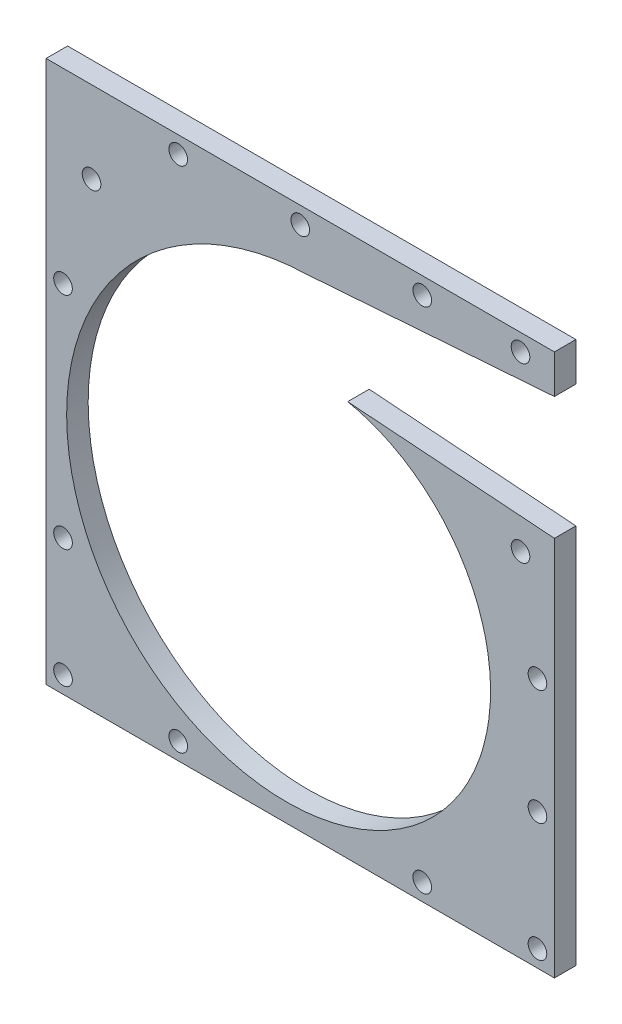
ISO-10303-21;
HEADER;
FILE_DESCRIPTION(('STEP AP214'),'2;1');
FILE_NAME('part.step','',(''),(''),'','','');
FILE_SCHEMA(('AUTOMOTIVE_DESIGN { 1 0 10303 214 1 1 1 1 }'));
ENDSEC;
DATA;
#1=APPLICATION_CONTEXT('core data for automotive mechanical design processes');
#2=APPLICATION_PROTOCOL_DEFINITION('international standard','automotive_design',2000,#1);
#3=PRODUCT_CONTEXT('',#1,'mechanical');
#4=PRODUCT('Part','Part','',(#3));
#5=PRODUCT_RELATED_PRODUCT_CATEGORY('part','',(#4));
#6=PRODUCT_DEFINITION_FORMATION('','',#4);
#7=PRODUCT_DEFINITION_CONTEXT('part definition',#1,'design');
#8=PRODUCT_DEFINITION('design','',#6,#7);
#9=PRODUCT_DEFINITION_SHAPE('','',#8);
#10=(LENGTH_UNIT() NAMED_UNIT(*) SI_UNIT(.MILLI.,.METRE.));
#11=(NAMED_UNIT(*) PLANE_ANGLE_UNIT() SI_UNIT($,.RADIAN.));
#12=(NAMED_UNIT(*) SI_UNIT($,.STERADIAN.) SOLID_ANGLE_UNIT());
#13=UNCERTAINTY_MEASURE_WITH_UNIT(LENGTH_MEASURE(1.E-05),#10,'distance_accuracy_value','');
#14=(GEOMETRIC_REPRESENTATION_CONTEXT(3) GLOBAL_UNCERTAINTY_ASSIGNED_CONTEXT((#13)) GLOBAL_UNIT_ASSIGNED_CONTEXT((#10,
#11,#12)) REPRESENTATION_CONTEXT('',''));
#15=CARTESIAN_POINT('',(0.,0.,0.));
#16=DIRECTION('',(0.,0.,1.));
#17=DIRECTION('',(1.,0.,0.));
#18=AXIS2_PLACEMENT_3D('',#15,#16,#17);
#19=CARTESIAN_POINT('',(131.81817467106,-7.78230033006967,6.35));
#20=DIRECTION('',(-1.,0.,0.));
#21=DIRECTION('',(0.,0.,1.));
#22=AXIS2_PLACEMENT_3D('',#19,#20,#21);
#23=PLANE('',#22);
#24=DIRECTION('',(0.,1.,0.));
#25=VECTOR('',#24,1.);
#26=CARTESIAN_POINT('',(131.81817467106,-7.78230033006967,6.35));
#27=LINE('',#26,#25);
#28=CARTESIAN_POINT('',(131.81817467106,140.809388742686,6.35));
#29=VERTEX_POINT('',#28);
#30=CARTESIAN_POINT('',(131.81817467106,152.21769966993,6.35));
#31=VERTEX_POINT('',#30);
#32=EDGE_CURVE('E124',#29,#31,#27,.T.);
#33=ORIENTED_EDGE('',*,*,#32,.F.);
#34=DIRECTION('',(0.,0.,1.));
#35=VECTOR('',#34,1.);
#36=CARTESIAN_POINT('',(131.81817467106,140.809388742686,-0.00100000000000013));
#37=LINE('',#36,#35);
#38=CARTESIAN_POINT('',(131.81817467106,140.809388742686,0.));
#39=VERTEX_POINT('',#38);
#40=EDGE_CURVE('E111',#39,#29,#37,.T.);
#41=ORIENTED_EDGE('',*,*,#40,.F.);
#42=DIRECTION('',(0.,1.,0.));
#43=VECTOR('',#42,1.);
#44=CARTESIAN_POINT('',(131.81817467106,-7.78230033006967,0.));
#45=LINE('',#44,#43);
#46=CARTESIAN_POINT('',(131.81817467106,152.21769966993,0.));
#47=VERTEX_POINT('',#46);
#48=EDGE_CURVE('E123',#39,#47,#45,.T.);
#49=ORIENTED_EDGE('',*,*,#48,.T.);
#50=DIRECTION('',(0.,0.,-1.));
#51=VECTOR('',#50,1.);
#52=CARTESIAN_POINT('',(131.81817467106,152.21769966993,6.35));
#53=LINE('',#52,#51);
#54=EDGE_CURVE('E140',#31,#47,#53,.T.);
#55=ORIENTED_EDGE('',*,*,#54,.F.);
#56=EDGE_LOOP('',(#33,#41,#49,#55));
#57=FACE_BOUND('',#56,.T.);
#58=ADVANCED_FACE('F33',(#57),#23,.F.);
#59=CARTESIAN_POINT('',(-18.1818253289395,-7.78230033006967,6.35));
#60=DIRECTION('',(1.,0.,0.));
#61=DIRECTION('',(0.,0.,-1.));
#62=AXIS2_PLACEMENT_3D('',#59,#60,#61);
#63=PLANE('',#62);
#64=DIRECTION('',(0.,-1.,0.));
#65=VECTOR('',#64,1.);
#66=CARTESIAN_POINT('',(-18.1818253289395,-7.78230033006967,0.));
#67=LINE('',#66,#65);
#68=CARTESIAN_POINT('',(-18.1818253289395,152.21769966993,0.));
#69=VERTEX_POINT('',#68);
#70=CARTESIAN_POINT('',(-18.1818253289395,-7.78230033006967,0.));
#71=VERTEX_POINT('',#70);
#72=EDGE_CURVE('E132',#69,#71,#67,.T.);
#73=ORIENTED_EDGE('',*,*,#72,.T.);
#74=DIRECTION('',(0.,0.,-1.));
#75=VECTOR('',#74,1.);
#76=CARTESIAN_POINT('',(-18.1818253289395,-7.78230033006967,6.35));
#77=LINE('',#76,#75);
#78=CARTESIAN_POINT('',(-18.1818253289395,-7.78230033006967,6.35));
#79=VERTEX_POINT('',#78);
#80=EDGE_CURVE('E11',#79,#71,#77,.T.);
#81=ORIENTED_EDGE('',*,*,#80,.F.);
#82=DIRECTION('',(0.,-1.,0.));
#83=VECTOR('',#82,1.);
#84=CARTESIAN_POINT('',(-18.1818253289395,-7.78230033006967,6.35));
#85=LINE('',#84,#83);
#86=CARTESIAN_POINT('',(-18.1818253289395,152.21769966993,6.35));
#87=VERTEX_POINT('',#86);
#88=EDGE_CURVE('E137',#87,#79,#85,.T.);
#89=ORIENTED_EDGE('',*,*,#88,.F.);
#90=DIRECTION('',(0.,0.,-1.));
#91=VECTOR('',#90,1.);
#92=CARTESIAN_POINT('',(-18.1818253289395,152.21769966993,6.35));
#93=LINE('',#92,#91);
#94=EDGE_CURVE('E138',#87,#69,#93,.T.);
#95=ORIENTED_EDGE('',*,*,#94,.T.);
#96=EDGE_LOOP('',(#73,#81,#89,#95));
#97=FACE_BOUND('',#96,.T.);
#98=ADVANCED_FACE('F35',(#97),#63,.F.);
#99=CARTESIAN_POINT('',(-18.1818253289395,-7.78230033006967,6.35));
#100=DIRECTION('',(0.,1.,0.));
#101=DIRECTION('',(0.,0.,1.));
#102=AXIS2_PLACEMENT_3D('',#99,#100,#101);
#103=PLANE('',#102);
#104=DIRECTION('',(1.,0.,0.));
#105=VECTOR('',#104,1.);
#106=CARTESIAN_POINT('',(-18.1818253289395,-7.78230033006967,0.));
#107=LINE('',#106,#105);
#108=CARTESIAN_POINT('',(131.81817467106,-7.78230033006967,0.));
#109=VERTEX_POINT('',#108);
#110=EDGE_CURVE('E129',#71,#109,#107,.T.);
#111=ORIENTED_EDGE('',*,*,#110,.T.);
#112=DIRECTION('',(0.,0.,-1.));
#113=VECTOR('',#112,1.);
#114=CARTESIAN_POINT('',(131.81817467106,-7.78230033006967,6.35));
#115=LINE('',#114,#113);
#116=CARTESIAN_POINT('',(131.81817467106,-7.78230033006967,6.35));
#117=VERTEX_POINT('',#116);
#118=EDGE_CURVE('E41',#117,#109,#115,.T.);
#119=ORIENTED_EDGE('',*,*,#118,.F.);
#120=DIRECTION('',(1.,0.,0.));
#121=VECTOR('',#120,1.);
#122=CARTESIAN_POINT('',(-18.1818253289395,-7.78230033006967,6.35));
#123=LINE('',#122,#121);
#124=EDGE_CURVE('E85',#79,#117,#123,.T.);
#125=ORIENTED_EDGE('',*,*,#124,.F.);
#126=ORIENTED_EDGE('',*,*,#80,.T.);
#127=EDGE_LOOP('',(#111,#119,#125,#126));
#128=FACE_BOUND('',#127,.T.);
#129=ADVANCED_FACE('F168',(#128),#103,.F.);
#130=CARTESIAN_POINT('',(131.81817467106,104.5788088434,0.));
#131=VERTEX_POINT('',#130);
#132=EDGE_CURVE('E128',#109,#131,#45,.T.);
#133=ORIENTED_EDGE('',*,*,#132,.T.);
#134=DIRECTION('',(0.,0.,1.));
#135=VECTOR('',#134,1.);
#136=CARTESIAN_POINT('',(131.81817467106,104.5788088434,-0.00100000000000013));
#137=LINE('',#136,#135);
#138=CARTESIAN_POINT('',(131.81817467106,104.5788088434,6.35));
#139=VERTEX_POINT('',#138);
#140=EDGE_CURVE('E48',#131,#139,#137,.T.);
#141=ORIENTED_EDGE('',*,*,#140,.T.);
#142=EDGE_CURVE('E147',#117,#139,#27,.T.);
#143=ORIENTED_EDGE('',*,*,#142,.F.);
#144=ORIENTED_EDGE('',*,*,#118,.T.);
#145=EDGE_LOOP('',(#133,#141,#143,#144));
#146=FACE_BOUND('',#145,.T.);
#147=ADVANCED_FACE('F145',(#146),#23,.F.);
#148=CARTESIAN_POINT('',(-18.1818253289395,152.21769966993,6.35));
#149=DIRECTION('',(0.,-1.,0.));
#150=DIRECTION('',(0.,0.,-1.));
#151=AXIS2_PLACEMENT_3D('',#148,#149,#150);
#152=PLANE('',#151);
#153=DIRECTION('',(-1.,0.,0.));
#154=VECTOR('',#153,1.);
#155=CARTESIAN_POINT('',(-18.1818253289395,152.21769966993,0.));
#156=LINE('',#155,#154);
#157=EDGE_CURVE('E78',#47,#69,#156,.T.);
#158=ORIENTED_EDGE('',*,*,#157,.T.);
#159=ORIENTED_EDGE('',*,*,#94,.F.);
#160=DIRECTION('',(-1.,0.,0.));
#161=VECTOR('',#160,1.);
#162=CARTESIAN_POINT('',(-18.1818253289395,152.21769966993,6.35));
#163=LINE('',#162,#161);
#164=EDGE_CURVE('E57',#31,#87,#163,.T.);
#165=ORIENTED_EDGE('',*,*,#164,.F.);
#166=ORIENTED_EDGE('',*,*,#54,.T.);
#167=EDGE_LOOP('',(#158,#159,#165,#166));
#168=FACE_BOUND('',#167,.T.);
#169=ADVANCED_FACE('F164',(#168),#152,.F.);
#170=CARTESIAN_POINT('',(0.,0.,6.35));
#171=DIRECTION('',(0.,0.,-1.));
#172=DIRECTION('',(-1.,0.,0.));
#173=AXIS2_PLACEMENT_3D('',#170,#171,#172);
#174=PLANE('',#173);
#175=CARTESIAN_POINT('',(121.81817467106,96.2176996699304,6.35));
#176=DIRECTION('',(0.,0.,1.));
#177=DIRECTION('',(1.,0.,0.));
#178=AXIS2_PLACEMENT_3D('',#175,#176,#177);
#179=CIRCLE('',#178,2.75000000000001);
#180=CARTESIAN_POINT('',(124.56817467106,96.2176996699304,6.35));
#181=VERTEX_POINT('',#180);
#182=EDGE_CURVE('E293',#181,#181,#179,.T.);
#183=ORIENTED_EDGE('',*,*,#182,.F.);
#184=EDGE_LOOP('',(#183));
#185=FACE_BOUND('',#184,.T.);
#186=CARTESIAN_POINT('',(126.81817467106,66.2176996699304,6.35));
#187=DIRECTION('',(0.,0.,1.));
#188=DIRECTION('',(1.,0.,0.));
#189=AXIS2_PLACEMENT_3D('',#186,#187,#188);
#190=CIRCLE('',#189,2.75000000000001);
#191=CARTESIAN_POINT('',(129.56817467106,66.2176996699304,6.35));
#192=VERTEX_POINT('',#191);
#193=EDGE_CURVE('E287',#192,#192,#190,.T.);
#194=ORIENTED_EDGE('',*,*,#193,.F.);
#195=EDGE_LOOP('',(#194));
#196=FACE_BOUND('',#195,.T.);
#197=CARTESIAN_POINT('',(126.81817467106,32.2176996699304,6.35));
#198=DIRECTION('',(0.,0.,1.));
#199=DIRECTION('',(1.,0.,0.));
#200=AXIS2_PLACEMENT_3D('',#197,#198,#199);
#201=CIRCLE('',#200,2.75000000000001);
#202=CARTESIAN_POINT('',(129.56817467106,32.2176996699304,6.35));
#203=VERTEX_POINT('',#202);
#204=EDGE_CURVE('E281',#203,#203,#201,.T.);
#205=ORIENTED_EDGE('',*,*,#204,.F.);
#206=EDGE_LOOP('',(#205));
#207=FACE_BOUND('',#206,.T.);
#208=CARTESIAN_POINT('',(126.81817467106,-2.78230033006961,6.35));
#209=DIRECTION('',(0.,0.,1.));
#210=DIRECTION('',(1.,0.,0.));
#211=AXIS2_PLACEMENT_3D('',#208,#209,#210);
#212=CIRCLE('',#211,2.74999999999998);
#213=CARTESIAN_POINT('',(129.56817467106,-2.78230033006961,6.35));
#214=VERTEX_POINT('',#213);
#215=EDGE_CURVE('E275',#214,#214,#212,.T.);
#216=ORIENTED_EDGE('',*,*,#215,.F.);
#217=EDGE_LOOP('',(#216));
#218=FACE_BOUND('',#217,.T.);
#219=CARTESIAN_POINT('',(92.8181746710605,-2.78230033006963,6.35));
#220=DIRECTION('',(0.,0.,1.));
#221=DIRECTION('',(1.,0.,0.));
#222=AXIS2_PLACEMENT_3D('',#219,#220,#221);
#223=CIRCLE('',#222,2.74999999999999);
#224=CARTESIAN_POINT('',(95.5681746710605,-2.78230033006963,6.35));
#225=VERTEX_POINT('',#224);
#226=EDGE_CURVE('E269',#225,#225,#223,.T.);
#227=ORIENTED_EDGE('',*,*,#226,.F.);
#228=EDGE_LOOP('',(#227));
#229=FACE_BOUND('',#228,.T.);
#230=CARTESIAN_POINT('',(20.8181746710605,-2.78230033006961,6.35));
#231=DIRECTION('',(0.,0.,1.));
#232=DIRECTION('',(1.,0.,0.));
#233=AXIS2_PLACEMENT_3D('',#230,#231,#232);
#234=CIRCLE('',#233,2.75);
#235=CARTESIAN_POINT('',(23.5681746710605,-2.78230033006961,6.35));
#236=VERTEX_POINT('',#235);
#237=EDGE_CURVE('E263',#236,#236,#234,.T.);
#238=ORIENTED_EDGE('',*,*,#237,.F.);
#239=EDGE_LOOP('',(#238));
#240=FACE_BOUND('',#239,.T.);
#241=CARTESIAN_POINT('',(-13.1818253289395,-2.78230033006961,6.35));
#242=DIRECTION('',(0.,0.,1.));
#243=DIRECTION('',(1.,0.,0.));
#244=AXIS2_PLACEMENT_3D('',#241,#242,#243);
#245=CIRCLE('',#244,2.75);
#246=CARTESIAN_POINT('',(-10.4318253289395,-2.78230033006961,6.35));
#247=VERTEX_POINT('',#246);
#248=EDGE_CURVE('E257',#247,#247,#245,.T.);
#249=ORIENTED_EDGE('',*,*,#248,.F.);
#250=EDGE_LOOP('',(#249));
#251=FACE_BOUND('',#250,.T.);
#252=CARTESIAN_POINT('',(-13.1818253289395,32.2176996699304,6.35));
#253=DIRECTION('',(0.,0.,1.));
#254=DIRECTION('',(1.,0.,0.));
#255=AXIS2_PLACEMENT_3D('',#252,#253,#254);
#256=CIRCLE('',#255,2.75);
#257=CARTESIAN_POINT('',(-10.4318253289395,32.2176996699304,6.35));
#258=VERTEX_POINT('',#257);
#259=EDGE_CURVE('E251',#258,#258,#256,.T.);
#260=ORIENTED_EDGE('',*,*,#259,.F.);
#261=EDGE_LOOP('',(#260));
#262=FACE_BOUND('',#261,.T.);
#263=CARTESIAN_POINT('',(-13.1818253289396,97.2176996699304,6.35));
#264=DIRECTION('',(0.,0.,1.));
#265=DIRECTION('',(1.,0.,0.));
#266=AXIS2_PLACEMENT_3D('',#263,#264,#265);
#267=CIRCLE('',#266,2.75);
#268=CARTESIAN_POINT('',(-10.4318253289396,97.2176996699304,6.35));
#269=VERTEX_POINT('',#268);
#270=EDGE_CURVE('E245',#269,#269,#267,.T.);
#271=ORIENTED_EDGE('',*,*,#270,.F.);
#272=EDGE_LOOP('',(#271));
#273=FACE_BOUND('',#272,.T.);
#274=CARTESIAN_POINT('',(-4.7745961983402,128.093555906569,6.35));
#275=DIRECTION('',(0.,0.,1.));
#276=DIRECTION('',(1.,0.,0.));
#277=AXIS2_PLACEMENT_3D('',#274,#275,#276);
#278=CIRCLE('',#277,2.75000000000001);
#279=CARTESIAN_POINT('',(-2.0245961983402,128.093555906569,6.35));
#280=VERTEX_POINT('',#279);
#281=EDGE_CURVE('E239',#280,#280,#278,.T.);
#282=ORIENTED_EDGE('',*,*,#281,.F.);
#283=EDGE_LOOP('',(#282));
#284=FACE_BOUND('',#283,.T.);
#285=CARTESIAN_POINT('',(20.8181746710604,147.21769966993,6.35));
#286=DIRECTION('',(0.,0.,1.));
#287=DIRECTION('',(1.,0.,0.));
#288=AXIS2_PLACEMENT_3D('',#285,#286,#287);
#289=CIRCLE('',#288,2.75);
#290=CARTESIAN_POINT('',(23.5681746710604,147.21769966993,6.35));
#291=VERTEX_POINT('',#290);
#292=EDGE_CURVE('E233',#291,#291,#289,.T.);
#293=ORIENTED_EDGE('',*,*,#292,.F.);
#294=EDGE_LOOP('',(#293));
#295=FACE_BOUND('',#294,.T.);
#296=CARTESIAN_POINT('',(56.8181746710604,147.21769966993,6.35));
#297=DIRECTION('',(0.,0.,1.));
#298=DIRECTION('',(1.,0.,0.));
#299=AXIS2_PLACEMENT_3D('',#296,#297,#298);
#300=CIRCLE('',#299,2.75000000000001);
#301=CARTESIAN_POINT('',(59.5681746710605,147.21769966993,6.35));
#302=VERTEX_POINT('',#301);
#303=EDGE_CURVE('E227',#302,#302,#300,.T.);
#304=ORIENTED_EDGE('',*,*,#303,.F.);
#305=EDGE_LOOP('',(#304));
#306=FACE_BOUND('',#305,.T.);
#307=CARTESIAN_POINT('',(92.8181746710605,147.21769966993,6.35));
#308=DIRECTION('',(0.,0.,1.));
#309=DIRECTION('',(1.,0.,0.));
#310=AXIS2_PLACEMENT_3D('',#307,#308,#309);
#311=CIRCLE('',#310,2.75000000000002);
#312=CARTESIAN_POINT('',(95.5681746710605,147.21769966993,6.35));
#313=VERTEX_POINT('',#312);
#314=EDGE_CURVE('E222',#313,#313,#311,.T.);
#315=ORIENTED_EDGE('',*,*,#314,.F.);
#316=EDGE_LOOP('',(#315));
#317=FACE_BOUND('',#316,.T.);
#318=CARTESIAN_POINT('',(121.81817467106,147.21769966993,6.35));
#319=DIRECTION('',(0.,0.,1.));
#320=DIRECTION('',(1.,0.,0.));
#321=AXIS2_PLACEMENT_3D('',#318,#319,#320);
#322=CIRCLE('',#321,2.75000000000002);
#323=CARTESIAN_POINT('',(124.56817467106,147.21769966993,6.35));
#324=VERTEX_POINT('',#323);
#325=EDGE_CURVE('E211',#324,#324,#322,.T.);
#326=ORIENTED_EDGE('',*,*,#325,.F.);
#327=EDGE_LOOP('',(#326));
#328=FACE_BOUND('',#327,.T.);
#329=CARTESIAN_POINT('',(58.9214000295519,135.51433119546,6.35));
#330=CARTESIAN_POINT('',(54.1832252012254,135.390580552711,6.35));
#331=CARTESIAN_POINT('',(49.4811791212116,134.818294383119,6.35));
#332=CARTESIAN_POINT('',(40.3143270370534,132.814916259366,6.35));
#333=CARTESIAN_POINT('',(35.8497067088032,131.383908814256,6.35));
#334=CARTESIAN_POINT('',(27.3113098813154,127.731327501189,6.35));
#335=CARTESIAN_POINT('',(23.2376980288108,125.509870744257,6.35));
#336=CARTESIAN_POINT('',(15.6178631561521,120.371467782945,6.35));
#337=CARTESIAN_POINT('',(12.071778180712,117.454666428956,6.35));
#338=CARTESIAN_POINT('',(5.62192202345862,111.043539372666,6.35));
#339=CARTESIAN_POINT('',(2.71825778304008,107.549380476169,6.35));
#340=CARTESIAN_POINT('',(-2.35714333069762,100.119693236984,6.35));
#341=CARTESIAN_POINT('',(-4.52880765000477,96.1843471782258,6.35));
#342=CARTESIAN_POINT('',(-8.07861082646921,88.021368006585,6.35));
#343=CARTESIAN_POINT('',(-9.45671348535184,83.7939257347283,6.35));
#344=CARTESIAN_POINT('',(-11.3874484342981,75.2031396839304,6.35));
#345=CARTESIAN_POINT('',(-11.9400814860633,70.8399881999389,6.35));
#346=CARTESIAN_POINT('',(-12.2181181019159,62.1356974664072,6.35));
#347=CARTESIAN_POINT('',(-11.9435586304208,57.7947449441921,6.35));
#348=CARTESIAN_POINT('',(-10.5950667121722,49.2885813874234,6.35));
#349=CARTESIAN_POINT('',(-9.52120536648954,45.1235448288076,6.35));
#350=CARTESIAN_POINT('',(-6.62995153486292,37.1133141318664,6.35));
#351=CARTESIAN_POINT('',(-4.81266101177187,33.2682761113291,6.35));
#352=CARTESIAN_POINT('',(-0.515766072057898,26.0275328968687,6.35));
#353=CARTESIAN_POINT('',(1.96370986081187,22.6319601465299,6.35));
#354=CARTESIAN_POINT('',(7.48185763942838,16.4006789257721,6.35));
#355=CARTESIAN_POINT('',(10.520379707818,13.5650748801135,6.35));
#356=CARTESIAN_POINT('',(17.0357962281535,8.5417345056182,6.35));
#357=CARTESIAN_POINT('',(20.5125255137325,6.35407135114097,6.35));
#358=CARTESIAN_POINT('',(27.7705752596686,2.68941263794072,6.35));
#359=CARTESIAN_POINT('',(31.5517215161605,1.21245698255238,6.35));
#360=CARTESIAN_POINT('',(39.2769821069911,-0.994893307784299,6.35));
#361=CARTESIAN_POINT('',(43.220919755662,-1.72528206876122,6.35));
#362=CARTESIAN_POINT('',(51.1275872911127,-2.43120001063375,6.35));
#363=CARTESIAN_POINT('',(55.0901445244449,-2.40675683932256,6.35));
#364=CARTESIAN_POINT('',(62.8925881370057,-1.62197741777496,6.35));
#365=CARTESIAN_POINT('',(66.7323121275655,-0.861700606896201,6.35));
#366=CARTESIAN_POINT('',(74.1553886157406,1.34982876975539,6.35));
#367=CARTESIAN_POINT('',(77.738594715652,2.8009929695185,6.35));
#368=CARTESIAN_POINT('',(84.52735091309,6.32565833587609,6.35));
#369=CARTESIAN_POINT('',(87.7327756217776,8.39904608104586,6.35));
#370=CARTESIAN_POINT('',(93.6611963751031,13.0788411833024,6.35));
#371=CARTESIAN_POINT('',(96.3840921775814,15.6851147777265,6.35));
#372=CARTESIAN_POINT('',(101.262594087518,21.3244126392845,6.35));
#373=CARTESIAN_POINT('',(103.418128221415,24.3572881679707,6.35));
#374=CARTESIAN_POINT('',(107.099551849488,30.7308284722986,6.35));
#375=CARTESIAN_POINT('',(108.625399649337,34.0713353381564,6.35));
#376=CARTESIAN_POINT('',(111.009313557055,40.9331072200376,6.35));
#377=CARTESIAN_POINT('',(111.867369097047,44.4542111737959,6.35));
#378=CARTESIAN_POINT('',(112.902565452163,51.5468847583791,6.35));
#379=CARTESIAN_POINT('',(113.079726501959,55.118296179449,6.35));
#380=CARTESIAN_POINT('',(112.764857473672,62.1828433704138,6.35));
#381=CARTESIAN_POINT('',(112.272876974003,65.6758295508589,6.35));
#382=CARTESIAN_POINT('',(110.655251091939,72.4609753654911,6.35));
#383=CARTESIAN_POINT('',(109.52968211595,75.7529993510267,6.35));
#384=CARTESIAN_POINT('',(106.702307563576,82.0241592371306,6.35));
#385=CARTESIAN_POINT('',(105.00060176492,85.0031781138044,6.35));
#386=CARTESIAN_POINT('',(101.097626722405,90.5505633721843,6.35));
#387=CARTESIAN_POINT('',(98.8964763790319,93.1188352405475,6.35));
#388=CARTESIAN_POINT('',(94.0872327497071,97.7644466714173,6.35));
#389=CARTESIAN_POINT('',(91.479272622332,99.8417171903127,6.35));
#390=CARTESIAN_POINT('',(85.9611767992722,103.444994734487,6.35));
#391=CARTESIAN_POINT('',(83.051183234939,104.970960127402,6.35));
#392=CARTESIAN_POINT('',(77.041784389658,107.432911602492,6.35));
#393=CARTESIAN_POINT('',(73.9425247142314,108.368884336489,6.35));
#394=CARTESIAN_POINT('',(70.8067704787731,109.0017307388,6.35));
#395=B_SPLINE_CURVE_WITH_KNOTS('',3,(#329,#330,#331,#332,#333,#334,#335,#336,#337,#338,#339,
#340,#341,#342,#343,#344,#345,#346,#347,#348,#349,#350,#351,#352,#353,#354,#355,#356,#357,#358,
#359,#360,#361,#362,#363,#364,#365,#366,#367,#368,#369,#370,#371,#372,#373,#374,#375,#376,#377,
#378,#379,#380,#381,#382,#383,#384,#385,#386,#387,#388,#389,#390,#391,#392,#393,#394),
.UNSPECIFIED.,.F.,.F.,(4,2,2,2,2,2,2,2,2,2,2,2,2,2,2,2,2,2,2,2,2,2,2,2,2,2,2,2,2,2,2,2,4),(0.,
0.03125,0.0625,0.09375,0.125,0.15625,0.1875,0.21875,0.25,0.28125,0.3125,0.34375,0.375,0.40625,
0.4375,0.46875,0.5,0.53125,0.5625,0.59375,0.625,0.65625,0.6875,0.71875,0.75,0.78125,0.8125,
0.84375,0.875,0.90625,0.9375,0.96875,1.),.UNSPECIFIED.);
#396=CARTESIAN_POINT('',(58.9214000295519,135.51433119546,6.35));
#397=VERTEX_POINT('',#396);
#398=CARTESIAN_POINT('',(70.8067704787731,109.0017307388,6.35));
#399=VERTEX_POINT('',#398);
#400=EDGE_CURVE('E117',#397,#399,#395,.T.);
#401=ORIENTED_EDGE('',*,*,#400,.F.);
#402=DIRECTION('',(-0.997372272616975,-0.0724468758115244,0.));
#403=VECTOR('',#402,1.);
#404=CARTESIAN_POINT('',(58.9214000295519,135.51433119546,6.35));
#405=LINE('',#404,#403);
#406=EDGE_CURVE('E163',#29,#397,#405,.T.);
#407=ORIENTED_EDGE('',*,*,#406,.F.);
#408=ORIENTED_EDGE('',*,*,#32,.T.);
#409=ORIENTED_EDGE('',*,*,#164,.T.);
#410=ORIENTED_EDGE('',*,*,#88,.T.);
#411=ORIENTED_EDGE('',*,*,#124,.T.);
#412=ORIENTED_EDGE('',*,*,#142,.T.);
#413=DIRECTION('',(0.997382667751315,-0.0723036241779725,0.));
#414=VECTOR('',#413,1.);
#415=CARTESIAN_POINT('',(131.81817467106,104.5788088434,6.35));
#416=LINE('',#415,#414);
#417=EDGE_CURVE('E206',#399,#139,#416,.T.);
#418=ORIENTED_EDGE('',*,*,#417,.F.);
#419=EDGE_LOOP('',(#401,#407,#408,#409,#410,#411,#412,#418));
#420=FACE_BOUND('',#419,.T.);
#421=ADVANCED_FACE('F162',(#185,#196,#207,#218,#229,#240,#251,#262,#273,#284,#295,#306,#317,
#328,#420),#174,.F.);
#422=CARTESIAN_POINT('',(0.,0.,0.));
#423=DIRECTION('',(0.,0.,-1.));
#424=DIRECTION('',(-1.,0.,0.));
#425=AXIS2_PLACEMENT_3D('',#422,#423,#424);
#426=PLANE('',#425);
#427=CARTESIAN_POINT('',(121.81817467106,96.2176996699304,0.));
#428=DIRECTION('',(0.,0.,-1.));
#429=DIRECTION('',(-1.,0.,0.));
#430=AXIS2_PLACEMENT_3D('',#427,#428,#429);
#431=CIRCLE('',#430,2.75000000000001);
#432=CARTESIAN_POINT('',(119.06817467106,96.2176996699304,0.));
#433=VERTEX_POINT('',#432);
#434=EDGE_CURVE('E296',#433,#433,#431,.F.);
#435=ORIENTED_EDGE('',*,*,#434,.T.);
#436=EDGE_LOOP('',(#435));
#437=FACE_BOUND('',#436,.T.);
#438=CARTESIAN_POINT('',(126.81817467106,66.2176996699304,0.));
#439=DIRECTION('',(0.,0.,-1.));
#440=DIRECTION('',(-1.,0.,0.));
#441=AXIS2_PLACEMENT_3D('',#438,#439,#440);
#442=CIRCLE('',#441,2.75000000000001);
#443=CARTESIAN_POINT('',(124.06817467106,66.2176996699304,0.));
#444=VERTEX_POINT('',#443);
#445=EDGE_CURVE('E290',#444,#444,#442,.F.);
#446=ORIENTED_EDGE('',*,*,#445,.T.);
#447=EDGE_LOOP('',(#446));
#448=FACE_BOUND('',#447,.T.);
#449=CARTESIAN_POINT('',(126.81817467106,32.2176996699304,0.));
#450=DIRECTION('',(0.,0.,-1.));
#451=DIRECTION('',(-1.,0.,0.));
#452=AXIS2_PLACEMENT_3D('',#449,#450,#451);
#453=CIRCLE('',#452,2.75000000000001);
#454=CARTESIAN_POINT('',(124.06817467106,32.2176996699304,0.));
#455=VERTEX_POINT('',#454);
#456=EDGE_CURVE('E284',#455,#455,#453,.F.);
#457=ORIENTED_EDGE('',*,*,#456,.T.);
#458=EDGE_LOOP('',(#457));
#459=FACE_BOUND('',#458,.T.);
#460=CARTESIAN_POINT('',(126.81817467106,-2.78230033006961,0.));
#461=DIRECTION('',(0.,0.,-1.));
#462=DIRECTION('',(-1.,0.,0.));
#463=AXIS2_PLACEMENT_3D('',#460,#461,#462);
#464=CIRCLE('',#463,2.74999999999998);
#465=CARTESIAN_POINT('',(124.068174671061,-2.78230033006961,0.));
#466=VERTEX_POINT('',#465);
#467=EDGE_CURVE('E278',#466,#466,#464,.F.);
#468=ORIENTED_EDGE('',*,*,#467,.T.);
#469=EDGE_LOOP('',(#468));
#470=FACE_BOUND('',#469,.T.);
#471=CARTESIAN_POINT('',(92.8181746710605,-2.78230033006963,0.));
#472=DIRECTION('',(0.,0.,-1.));
#473=DIRECTION('',(-1.,0.,0.));
#474=AXIS2_PLACEMENT_3D('',#471,#472,#473);
#475=CIRCLE('',#474,2.74999999999999);
#476=CARTESIAN_POINT('',(90.0681746710605,-2.78230033006963,0.));
#477=VERTEX_POINT('',#476);
#478=EDGE_CURVE('E272',#477,#477,#475,.F.);
#479=ORIENTED_EDGE('',*,*,#478,.T.);
#480=EDGE_LOOP('',(#479));
#481=FACE_BOUND('',#480,.T.);
#482=CARTESIAN_POINT('',(20.8181746710605,-2.78230033006961,0.));
#483=DIRECTION('',(0.,0.,-1.));
#484=DIRECTION('',(-1.,0.,0.));
#485=AXIS2_PLACEMENT_3D('',#482,#483,#484);
#486=CIRCLE('',#485,2.75);
#487=CARTESIAN_POINT('',(18.0681746710605,-2.78230033006961,0.));
#488=VERTEX_POINT('',#487);
#489=EDGE_CURVE('E266',#488,#488,#486,.F.);
#490=ORIENTED_EDGE('',*,*,#489,.T.);
#491=EDGE_LOOP('',(#490));
#492=FACE_BOUND('',#491,.T.);
#493=CARTESIAN_POINT('',(-13.1818253289395,-2.78230033006961,0.));
#494=DIRECTION('',(0.,0.,-1.));
#495=DIRECTION('',(-1.,0.,0.));
#496=AXIS2_PLACEMENT_3D('',#493,#494,#495);
#497=CIRCLE('',#496,2.75);
#498=CARTESIAN_POINT('',(-15.9318253289395,-2.78230033006961,0.));
#499=VERTEX_POINT('',#498);
#500=EDGE_CURVE('E260',#499,#499,#497,.F.);
#501=ORIENTED_EDGE('',*,*,#500,.T.);
#502=EDGE_LOOP('',(#501));
#503=FACE_BOUND('',#502,.T.);
#504=CARTESIAN_POINT('',(-13.1818253289395,32.2176996699304,0.));
#505=DIRECTION('',(0.,0.,-1.));
#506=DIRECTION('',(-1.,0.,0.));
#507=AXIS2_PLACEMENT_3D('',#504,#505,#506);
#508=CIRCLE('',#507,2.75);
#509=CARTESIAN_POINT('',(-15.9318253289395,32.2176996699304,0.));
#510=VERTEX_POINT('',#509);
#511=EDGE_CURVE('E254',#510,#510,#508,.F.);
#512=ORIENTED_EDGE('',*,*,#511,.T.);
#513=EDGE_LOOP('',(#512));
#514=FACE_BOUND('',#513,.T.);
#515=CARTESIAN_POINT('',(-13.1818253289396,97.2176996699304,0.));
#516=DIRECTION('',(0.,0.,-1.));
#517=DIRECTION('',(-1.,0.,0.));
#518=AXIS2_PLACEMENT_3D('',#515,#516,#517);
#519=CIRCLE('',#518,2.75);
#520=CARTESIAN_POINT('',(-15.9318253289396,97.2176996699304,0.));
#521=VERTEX_POINT('',#520);
#522=EDGE_CURVE('E248',#521,#521,#519,.F.);
#523=ORIENTED_EDGE('',*,*,#522,.T.);
#524=EDGE_LOOP('',(#523));
#525=FACE_BOUND('',#524,.T.);
#526=CARTESIAN_POINT('',(-4.7745961983402,128.093555906569,0.));
#527=DIRECTION('',(0.,0.,-1.));
#528=DIRECTION('',(-1.,0.,0.));
#529=AXIS2_PLACEMENT_3D('',#526,#527,#528);
#530=CIRCLE('',#529,2.75000000000001);
#531=CARTESIAN_POINT('',(-7.52459619834021,128.093555906569,0.));
#532=VERTEX_POINT('',#531);
#533=EDGE_CURVE('E242',#532,#532,#530,.F.);
#534=ORIENTED_EDGE('',*,*,#533,.T.);
#535=EDGE_LOOP('',(#534));
#536=FACE_BOUND('',#535,.T.);
#537=CARTESIAN_POINT('',(20.8181746710604,147.21769966993,0.));
#538=DIRECTION('',(0.,0.,-1.));
#539=DIRECTION('',(-1.,0.,0.));
#540=AXIS2_PLACEMENT_3D('',#537,#538,#539);
#541=CIRCLE('',#540,2.75);
#542=CARTESIAN_POINT('',(18.0681746710604,147.21769966993,0.));
#543=VERTEX_POINT('',#542);
#544=EDGE_CURVE('E236',#543,#543,#541,.F.);
#545=ORIENTED_EDGE('',*,*,#544,.T.);
#546=EDGE_LOOP('',(#545));
#547=FACE_BOUND('',#546,.T.);
#548=CARTESIAN_POINT('',(56.8181746710604,147.21769966993,0.));
#549=DIRECTION('',(0.,0.,-1.));
#550=DIRECTION('',(-1.,0.,0.));
#551=AXIS2_PLACEMENT_3D('',#548,#549,#550);
#552=CIRCLE('',#551,2.75000000000001);
#553=CARTESIAN_POINT('',(54.0681746710604,147.21769966993,0.));
#554=VERTEX_POINT('',#553);
#555=EDGE_CURVE('E230',#554,#554,#552,.F.);
#556=ORIENTED_EDGE('',*,*,#555,.T.);
#557=EDGE_LOOP('',(#556));
#558=FACE_BOUND('',#557,.T.);
#559=CARTESIAN_POINT('',(92.8181746710605,147.21769966993,0.));
#560=DIRECTION('',(0.,0.,-1.));
#561=DIRECTION('',(-1.,0.,0.));
#562=AXIS2_PLACEMENT_3D('',#559,#560,#561);
#563=CIRCLE('',#562,2.75000000000002);
#564=CARTESIAN_POINT('',(90.0681746710604,147.21769966993,0.));
#565=VERTEX_POINT('',#564);
#566=EDGE_CURVE('E224',#565,#565,#563,.F.);
#567=ORIENTED_EDGE('',*,*,#566,.T.);
#568=EDGE_LOOP('',(#567));
#569=FACE_BOUND('',#568,.T.);
#570=CARTESIAN_POINT('',(121.81817467106,147.21769966993,0.));
#571=DIRECTION('',(0.,0.,-1.));
#572=DIRECTION('',(-1.,0.,0.));
#573=AXIS2_PLACEMENT_3D('',#570,#571,#572);
#574=CIRCLE('',#573,2.75000000000002);
#575=CARTESIAN_POINT('',(119.06817467106,147.21769966993,0.));
#576=VERTEX_POINT('',#575);
#577=EDGE_CURVE('E213',#576,#576,#574,.F.);
#578=ORIENTED_EDGE('',*,*,#577,.T.);
#579=EDGE_LOOP('',(#578));
#580=FACE_BOUND('',#579,.T.);
#581=DIRECTION('',(-0.997372272616975,-0.0724468758115244,0.));
#582=VECTOR('',#581,1.);
#583=CARTESIAN_POINT('',(58.9214000295519,135.51433119546,0.));
#584=LINE('',#583,#582);
#585=CARTESIAN_POINT('',(58.9214000295519,135.51433119546,0.));
#586=VERTEX_POINT('',#585);
#587=EDGE_CURVE('E107',#39,#586,#584,.T.);
#588=ORIENTED_EDGE('',*,*,#587,.T.);
#589=CARTESIAN_POINT('',(58.9214000295519,135.51433119546,0.));
#590=CARTESIAN_POINT('',(54.1832252012254,135.390580552711,0.));
#591=CARTESIAN_POINT('',(49.4811791212116,134.818294383119,0.));
#592=CARTESIAN_POINT('',(40.3143270370534,132.814916259366,0.));
#593=CARTESIAN_POINT('',(35.8497067088032,131.383908814256,0.));
#594=CARTESIAN_POINT('',(27.3113098813154,127.731327501189,0.));
#595=CARTESIAN_POINT('',(23.2376980288108,125.509870744257,0.));
#596=CARTESIAN_POINT('',(15.6178631561521,120.371467782945,0.));
#597=CARTESIAN_POINT('',(12.071778180712,117.454666428956,0.));
#598=CARTESIAN_POINT('',(5.62192202345862,111.043539372666,0.));
#599=CARTESIAN_POINT('',(2.71825778304008,107.549380476169,0.));
#600=CARTESIAN_POINT('',(-2.35714333069762,100.119693236984,0.));
#601=CARTESIAN_POINT('',(-4.52880765000477,96.1843471782258,0.));
#602=CARTESIAN_POINT('',(-8.07861082646921,88.021368006585,0.));
#603=CARTESIAN_POINT('',(-9.45671348535184,83.7939257347283,0.));
#604=CARTESIAN_POINT('',(-11.3874484342981,75.2031396839304,0.));
#605=CARTESIAN_POINT('',(-11.9400814860633,70.8399881999389,0.));
#606=CARTESIAN_POINT('',(-12.2181181019159,62.1356974664072,0.));
#607=CARTESIAN_POINT('',(-11.9435586304208,57.7947449441921,0.));
#608=CARTESIAN_POINT('',(-10.5950667121722,49.2885813874234,0.));
#609=CARTESIAN_POINT('',(-9.52120536648954,45.1235448288076,0.));
#610=CARTESIAN_POINT('',(-6.62995153486292,37.1133141318664,0.));
#611=CARTESIAN_POINT('',(-4.81266101177187,33.2682761113291,0.));
#612=CARTESIAN_POINT('',(-0.515766072057898,26.0275328968687,0.));
#613=CARTESIAN_POINT('',(1.96370986081187,22.6319601465299,0.));
#614=CARTESIAN_POINT('',(7.48185763942838,16.4006789257721,0.));
#615=CARTESIAN_POINT('',(10.520379707818,13.5650748801135,0.));
#616=CARTESIAN_POINT('',(17.0357962281535,8.5417345056182,0.));
#617=CARTESIAN_POINT('',(20.5125255137325,6.35407135114097,0.));
#618=CARTESIAN_POINT('',(27.7705752596686,2.68941263794072,0.));
#619=CARTESIAN_POINT('',(31.5517215161605,1.21245698255238,0.));
#620=CARTESIAN_POINT('',(39.2769821069911,-0.994893307784299,0.));
#621=CARTESIAN_POINT('',(43.220919755662,-1.72528206876122,0.));
#622=CARTESIAN_POINT('',(51.1275872911127,-2.43120001063375,0.));
#623=CARTESIAN_POINT('',(55.0901445244449,-2.40675683932256,0.));
#624=CARTESIAN_POINT('',(62.8925881370057,-1.62197741777496,0.));
#625=CARTESIAN_POINT('',(66.7323121275655,-0.861700606896201,0.));
#626=CARTESIAN_POINT('',(74.1553886157406,1.34982876975539,0.));
#627=CARTESIAN_POINT('',(77.738594715652,2.8009929695185,0.));
#628=CARTESIAN_POINT('',(84.52735091309,6.32565833587609,0.));
#629=CARTESIAN_POINT('',(87.7327756217776,8.39904608104586,0.));
#630=CARTESIAN_POINT('',(93.6611963751031,13.0788411833024,0.));
#631=CARTESIAN_POINT('',(96.3840921775814,15.6851147777265,0.));
#632=CARTESIAN_POINT('',(101.262594087518,21.3244126392845,0.));
#633=CARTESIAN_POINT('',(103.418128221415,24.3572881679707,0.));
#634=CARTESIAN_POINT('',(107.099551849488,30.7308284722986,0.));
#635=CARTESIAN_POINT('',(108.625399649337,34.0713353381564,0.));
#636=CARTESIAN_POINT('',(111.009313557055,40.9331072200376,0.));
#637=CARTESIAN_POINT('',(111.867369097047,44.4542111737959,0.));
#638=CARTESIAN_POINT('',(112.902565452163,51.5468847583791,0.));
#639=CARTESIAN_POINT('',(113.079726501959,55.118296179449,0.));
#640=CARTESIAN_POINT('',(112.764857473672,62.1828433704138,0.));
#641=CARTESIAN_POINT('',(112.272876974003,65.6758295508589,0.));
#642=CARTESIAN_POINT('',(110.655251091939,72.4609753654911,0.));
#643=CARTESIAN_POINT('',(109.52968211595,75.7529993510267,0.));
#644=CARTESIAN_POINT('',(106.702307563576,82.0241592371306,0.));
#645=CARTESIAN_POINT('',(105.00060176492,85.0031781138044,0.));
#646=CARTESIAN_POINT('',(101.097626722405,90.5505633721843,0.));
#647=CARTESIAN_POINT('',(98.8964763790319,93.1188352405475,0.));
#648=CARTESIAN_POINT('',(94.0872327497071,97.7644466714173,0.));
#649=CARTESIAN_POINT('',(91.479272622332,99.8417171903127,0.));
#650=CARTESIAN_POINT('',(85.9611767992722,103.444994734487,0.));
#651=CARTESIAN_POINT('',(83.051183234939,104.970960127402,0.));
#652=CARTESIAN_POINT('',(77.041784389658,107.432911602492,0.));
#653=CARTESIAN_POINT('',(73.9425247142314,108.368884336489,0.));
#654=CARTESIAN_POINT('',(70.8067704787731,109.0017307388,0.));
#655=B_SPLINE_CURVE_WITH_KNOTS('',3,(#589,#590,#591,#592,#593,#594,#595,#596,#597,#598,#599,
#600,#601,#602,#603,#604,#605,#606,#607,#608,#609,#610,#611,#612,#613,#614,#615,#616,#617,#618,
#619,#620,#621,#622,#623,#624,#625,#626,#627,#628,#629,#630,#631,#632,#633,#634,#635,#636,#637,
#638,#639,#640,#641,#642,#643,#644,#645,#646,#647,#648,#649,#650,#651,#652,#653,#654),
.UNSPECIFIED.,.F.,.F.,(4,2,2,2,2,2,2,2,2,2,2,2,2,2,2,2,2,2,2,2,2,2,2,2,2,2,2,2,2,2,2,2,4),(0.,
0.03125,0.0625,0.09375,0.125,0.15625,0.1875,0.21875,0.25,0.28125,0.3125,0.34375,0.375,0.40625,
0.4375,0.46875,0.5,0.53125,0.5625,0.59375,0.625,0.65625,0.6875,0.71875,0.75,0.78125,0.8125,
0.84375,0.875,0.90625,0.9375,0.96875,1.),.UNSPECIFIED.);
#656=CARTESIAN_POINT('',(70.8067704787731,109.0017307388,0.));
#657=VERTEX_POINT('',#656);
#658=EDGE_CURVE('E118',#586,#657,#655,.T.);
#659=ORIENTED_EDGE('',*,*,#658,.T.);
#660=DIRECTION('',(0.997382667751315,-0.0723036241779725,0.));
#661=VECTOR('',#660,1.);
#662=CARTESIAN_POINT('',(131.81817467106,104.5788088434,0.));
#663=LINE('',#662,#661);
#664=EDGE_CURVE('E148',#657,#131,#663,.T.);
#665=ORIENTED_EDGE('',*,*,#664,.T.);
#666=ORIENTED_EDGE('',*,*,#132,.F.);
#667=ORIENTED_EDGE('',*,*,#110,.F.);
#668=ORIENTED_EDGE('',*,*,#72,.F.);
#669=ORIENTED_EDGE('',*,*,#157,.F.);
#670=ORIENTED_EDGE('',*,*,#48,.F.);
#671=EDGE_LOOP('',(#588,#659,#665,#666,#667,#668,#669,#670));
#672=FACE_BOUND('',#671,.T.);
#673=ADVANCED_FACE('F126',(#437,#448,#459,#470,#481,#492,#503,#514,#525,#536,#547,#558,#569,
#580,#672),#426,.T.);
#674=CARTESIAN_POINT('',(58.9214000295519,135.51433119546,-0.00100000000000013));
#675=CARTESIAN_POINT('',(54.1832252012254,135.390580552711,-0.00100000000000013));
#676=CARTESIAN_POINT('',(49.4811791212116,134.818294383119,-0.00100000000000013));
#677=CARTESIAN_POINT('',(40.3143270370534,132.814916259366,-0.00100000000000013));
#678=CARTESIAN_POINT('',(35.8497067088032,131.383908814256,-0.00100000000000013));
#679=CARTESIAN_POINT('',(27.3113098813154,127.731327501189,-0.00100000000000013));
#680=CARTESIAN_POINT('',(23.2376980288108,125.509870744257,-0.00100000000000013));
#681=CARTESIAN_POINT('',(15.6178631561521,120.371467782945,-0.00100000000000013));
#682=CARTESIAN_POINT('',(12.071778180712,117.454666428956,-0.00100000000000013));
#683=CARTESIAN_POINT('',(5.62192202345862,111.043539372666,-0.00100000000000013));
#684=CARTESIAN_POINT('',(2.71825778304008,107.549380476169,-0.00100000000000013));
#685=CARTESIAN_POINT('',(-2.35714333069762,100.119693236984,-0.00100000000000013));
#686=CARTESIAN_POINT('',(-4.52880765000477,96.1843471782258,-0.00100000000000013));
#687=CARTESIAN_POINT('',(-8.07861082646921,88.021368006585,-0.00100000000000013));
#688=CARTESIAN_POINT('',(-9.45671348535184,83.7939257347283,-0.00100000000000013));
#689=CARTESIAN_POINT('',(-11.3874484342981,75.2031396839304,-0.00100000000000013));
#690=CARTESIAN_POINT('',(-11.9400814860633,70.8399881999389,-0.00100000000000013));
#691=CARTESIAN_POINT('',(-12.2181181019159,62.1356974664072,-0.00100000000000013));
#692=CARTESIAN_POINT('',(-11.9435586304208,57.7947449441921,-0.00100000000000013));
#693=CARTESIAN_POINT('',(-10.5950667121722,49.2885813874234,-0.00100000000000013));
#694=CARTESIAN_POINT('',(-9.52120536648954,45.1235448288076,-0.00100000000000013));
#695=CARTESIAN_POINT('',(-6.62995153486292,37.1133141318664,-0.00100000000000013));
#696=CARTESIAN_POINT('',(-4.81266101177187,33.2682761113291,-0.00100000000000013));
#697=CARTESIAN_POINT('',(-0.515766072057898,26.0275328968687,-0.00100000000000013));
#698=CARTESIAN_POINT('',(1.96370986081187,22.6319601465299,-0.00100000000000013));
#699=CARTESIAN_POINT('',(7.48185763942838,16.4006789257721,-0.00100000000000013));
#700=CARTESIAN_POINT('',(10.520379707818,13.5650748801135,-0.00100000000000013));
#701=CARTESIAN_POINT('',(17.0357962281535,8.5417345056182,-0.00100000000000013));
#702=CARTESIAN_POINT('',(20.5125255137325,6.35407135114097,-0.00100000000000013));
#703=CARTESIAN_POINT('',(27.7705752596686,2.68941263794072,-0.00100000000000013));
#704=CARTESIAN_POINT('',(31.5517215161605,1.21245698255238,-0.00100000000000013));
#705=CARTESIAN_POINT('',(39.2769821069911,-0.994893307784299,-0.00100000000000013));
#706=CARTESIAN_POINT('',(43.220919755662,-1.72528206876122,-0.00100000000000013));
#707=CARTESIAN_POINT('',(51.1275872911127,-2.43120001063375,-0.00100000000000013));
#708=CARTESIAN_POINT('',(55.0901445244449,-2.40675683932256,-0.00100000000000013));
#709=CARTESIAN_POINT('',(62.8925881370057,-1.62197741777496,-0.00100000000000013));
#710=CARTESIAN_POINT('',(66.7323121275655,-0.861700606896201,-0.00100000000000013));
#711=CARTESIAN_POINT('',(74.1553886157406,1.34982876975539,-0.00100000000000013));
#712=CARTESIAN_POINT('',(77.738594715652,2.8009929695185,-0.00100000000000013));
#713=CARTESIAN_POINT('',(84.52735091309,6.32565833587609,-0.00100000000000013));
#714=CARTESIAN_POINT('',(87.7327756217776,8.39904608104586,-0.00100000000000013));
#715=CARTESIAN_POINT('',(93.6611963751031,13.0788411833024,-0.00100000000000013));
#716=CARTESIAN_POINT('',(96.3840921775814,15.6851147777265,-0.00100000000000013));
#717=CARTESIAN_POINT('',(101.262594087518,21.3244126392845,-0.00100000000000013));
#718=CARTESIAN_POINT('',(103.418128221415,24.3572881679707,-0.00100000000000013));
#719=CARTESIAN_POINT('',(107.099551849488,30.7308284722986,-0.00100000000000013));
#720=CARTESIAN_POINT('',(108.625399649337,34.0713353381564,-0.00100000000000013));
#721=CARTESIAN_POINT('',(111.009313557055,40.9331072200376,-0.00100000000000013));
#722=CARTESIAN_POINT('',(111.867369097047,44.4542111737959,-0.00100000000000013));
#723=CARTESIAN_POINT('',(112.902565452163,51.5468847583791,-0.00100000000000013));
#724=CARTESIAN_POINT('',(113.079726501959,55.118296179449,-0.00100000000000013));
#725=CARTESIAN_POINT('',(112.764857473672,62.1828433704138,-0.00100000000000013));
#726=CARTESIAN_POINT('',(112.272876974003,65.6758295508589,-0.00100000000000013));
#727=CARTESIAN_POINT('',(110.655251091939,72.4609753654911,-0.00100000000000013));
#728=CARTESIAN_POINT('',(109.52968211595,75.7529993510267,-0.00100000000000013));
#729=CARTESIAN_POINT('',(106.702307563576,82.0241592371306,-0.00100000000000013));
#730=CARTESIAN_POINT('',(105.00060176492,85.0031781138044,-0.00100000000000013));
#731=CARTESIAN_POINT('',(101.097626722405,90.5505633721843,-0.00100000000000013));
#732=CARTESIAN_POINT('',(98.8964763790319,93.1188352405475,-0.00100000000000013));
#733=CARTESIAN_POINT('',(94.0872327497071,97.7644466714173,-0.00100000000000013));
#734=CARTESIAN_POINT('',(91.479272622332,99.8417171903127,-0.00100000000000013));
#735=CARTESIAN_POINT('',(85.9611767992722,103.444994734487,-0.00100000000000013));
#736=CARTESIAN_POINT('',(83.051183234939,104.970960127402,-0.00100000000000013));
#737=CARTESIAN_POINT('',(77.041784389658,107.432911602492,-0.00100000000000013));
#738=CARTESIAN_POINT('',(73.9425247142314,108.368884336489,-0.00100000000000013));
#739=CARTESIAN_POINT('',(70.8067704787731,109.0017307388,-0.00100000000000013));
#740=B_SPLINE_CURVE_WITH_KNOTS('',3,(#674,#675,#676,#677,#678,#679,#680,#681,#682,#683,#684,
#685,#686,#687,#688,#689,#690,#691,#692,#693,#694,#695,#696,#697,#698,#699,#700,#701,#702,#703,
#704,#705,#706,#707,#708,#709,#710,#711,#712,#713,#714,#715,#716,#717,#718,#719,#720,#721,#722,
#723,#724,#725,#726,#727,#728,#729,#730,#731,#732,#733,#734,#735,#736,#737,#738,#739),
.UNSPECIFIED.,.F.,.F.,(4,2,2,2,2,2,2,2,2,2,2,2,2,2,2,2,2,2,2,2,2,2,2,2,2,2,2,2,2,2,2,2,4),(0.,
0.03125,0.0625,0.09375,0.125,0.15625,0.1875,0.21875,0.25,0.28125,0.3125,0.34375,0.375,0.40625,
0.4375,0.46875,0.5,0.53125,0.5625,0.59375,0.625,0.65625,0.6875,0.71875,0.75,0.78125,0.8125,
0.84375,0.875,0.90625,0.9375,0.96875,1.),.UNSPECIFIED.);
#741=DIRECTION('',(0.,0.,1.));
#742=VECTOR('',#741,1.);
#743=SURFACE_OF_LINEAR_EXTRUSION('',#740,#742);
#744=DIRECTION('',(0.,0.,1.));
#745=VECTOR('',#744,1.);
#746=CARTESIAN_POINT('',(58.9214000295519,135.51433119546,-0.00100000000000013));
#747=LINE('',#746,#745);
#748=EDGE_CURVE('E113',#586,#397,#747,.T.);
#749=ORIENTED_EDGE('',*,*,#748,.T.);
#750=ORIENTED_EDGE('',*,*,#400,.T.);
#751=DIRECTION('',(0.,0.,1.));
#752=VECTOR('',#751,1.);
#753=CARTESIAN_POINT('',(70.8067704787731,109.0017307388,-0.00100000000000013));
#754=LINE('',#753,#752);
#755=EDGE_CURVE('E155',#657,#399,#754,.T.);
#756=ORIENTED_EDGE('',*,*,#755,.F.);
#757=ORIENTED_EDGE('',*,*,#658,.F.);
#758=EDGE_LOOP('',(#749,#750,#756,#757));
#759=FACE_BOUND('',#758,.T.);
#760=ADVANCED_FACE('F183',(#759),#743,.F.);
#761=CARTESIAN_POINT('',(58.9214000295519,135.51433119546,-0.00100000000000013));
#762=DIRECTION('',(-0.0724468758115244,0.997372272616975,0.));
#763=DIRECTION('',(-0.997372272616975,-0.0724468758115244,0.));
#764=AXIS2_PLACEMENT_3D('',#761,#762,#763);
#765=PLANE('',#764);
#766=ORIENTED_EDGE('',*,*,#40,.T.);
#767=ORIENTED_EDGE('',*,*,#406,.T.);
#768=ORIENTED_EDGE('',*,*,#748,.F.);
#769=ORIENTED_EDGE('',*,*,#587,.F.);
#770=EDGE_LOOP('',(#766,#767,#768,#769));
#771=FACE_BOUND('',#770,.T.);
#772=ADVANCED_FACE('F109',(#771),#765,.F.);
#773=CARTESIAN_POINT('',(131.81817467106,104.5788088434,-0.00100000000000013));
#774=DIRECTION('',(-0.0723036241779725,-0.997382667751315,0.));
#775=DIRECTION('',(0.997382667751315,-0.0723036241779725,0.));
#776=AXIS2_PLACEMENT_3D('',#773,#774,#775);
#777=PLANE('',#776);
#778=ORIENTED_EDGE('',*,*,#755,.T.);
#779=ORIENTED_EDGE('',*,*,#417,.T.);
#780=ORIENTED_EDGE('',*,*,#140,.F.);
#781=ORIENTED_EDGE('',*,*,#664,.F.);
#782=EDGE_LOOP('',(#778,#779,#780,#781));
#783=FACE_BOUND('',#782,.T.);
#784=ADVANCED_FACE('F192',(#783),#777,.F.);
#785=CARTESIAN_POINT('',(121.81817467106,147.21769966993,-0.00100000000000013));
#786=DIRECTION('',(0.,0.,1.));
#787=DIRECTION('',(1.,0.,0.));
#788=AXIS2_PLACEMENT_3D('',#785,#786,#787);
#789=CYLINDRICAL_SURFACE('',#788,2.75000000000002);
#790=ORIENTED_EDGE('',*,*,#577,.F.);
#791=EDGE_LOOP('',(#790));
#792=FACE_BOUND('',#791,.T.);
#793=ORIENTED_EDGE('',*,*,#325,.T.);
#794=EDGE_LOOP('',(#793));
#795=FACE_BOUND('',#794,.T.);
#796=ADVANCED_FACE('F330',(#792,#795),#789,.F.);
#797=CARTESIAN_POINT('',(92.8181746710605,147.21769966993,-0.00100000000000013));
#798=DIRECTION('',(0.,0.,1.));
#799=DIRECTION('',(1.,0.,0.));
#800=AXIS2_PLACEMENT_3D('',#797,#798,#799);
#801=CYLINDRICAL_SURFACE('',#800,2.75000000000002);
#802=ORIENTED_EDGE('',*,*,#566,.F.);
#803=EDGE_LOOP('',(#802));
#804=FACE_BOUND('',#803,.T.);
#805=ORIENTED_EDGE('',*,*,#314,.T.);
#806=EDGE_LOOP('',(#805));
#807=FACE_BOUND('',#806,.T.);
#808=ADVANCED_FACE('F332',(#804,#807),#801,.F.);
#809=CARTESIAN_POINT('',(56.8181746710604,147.21769966993,-0.00100000000000013));
#810=DIRECTION('',(0.,0.,1.));
#811=DIRECTION('',(1.,0.,0.));
#812=AXIS2_PLACEMENT_3D('',#809,#810,#811);
#813=CYLINDRICAL_SURFACE('',#812,2.75000000000001);
#814=ORIENTED_EDGE('',*,*,#555,.F.);
#815=EDGE_LOOP('',(#814));
#816=FACE_BOUND('',#815,.T.);
#817=ORIENTED_EDGE('',*,*,#303,.T.);
#818=EDGE_LOOP('',(#817));
#819=FACE_BOUND('',#818,.T.);
#820=ADVANCED_FACE('F339',(#816,#819),#813,.F.);
#821=CARTESIAN_POINT('',(20.8181746710604,147.21769966993,-0.00100000000000013));
#822=DIRECTION('',(0.,0.,1.));
#823=DIRECTION('',(1.,0.,0.));
#824=AXIS2_PLACEMENT_3D('',#821,#822,#823);
#825=CYLINDRICAL_SURFACE('',#824,2.75);
#826=ORIENTED_EDGE('',*,*,#544,.F.);
#827=EDGE_LOOP('',(#826));
#828=FACE_BOUND('',#827,.T.);
#829=ORIENTED_EDGE('',*,*,#292,.T.);
#830=EDGE_LOOP('',(#829));
#831=FACE_BOUND('',#830,.T.);
#832=ADVANCED_FACE('F386',(#828,#831),#825,.F.);
#833=CARTESIAN_POINT('',(-4.7745961983402,128.093555906569,-0.00100000000000013));
#834=DIRECTION('',(0.,0.,1.));
#835=DIRECTION('',(1.,0.,0.));
#836=AXIS2_PLACEMENT_3D('',#833,#834,#835);
#837=CYLINDRICAL_SURFACE('',#836,2.75000000000001);
#838=ORIENTED_EDGE('',*,*,#533,.F.);
#839=EDGE_LOOP('',(#838));
#840=FACE_BOUND('',#839,.T.);
#841=ORIENTED_EDGE('',*,*,#281,.T.);
#842=EDGE_LOOP('',(#841));
#843=FACE_BOUND('',#842,.T.);
#844=ADVANCED_FACE('F395',(#840,#843),#837,.F.);
#845=CARTESIAN_POINT('',(-13.1818253289396,97.2176996699304,-0.00100000000000013));
#846=DIRECTION('',(0.,0.,1.));
#847=DIRECTION('',(1.,0.,0.));
#848=AXIS2_PLACEMENT_3D('',#845,#846,#847);
#849=CYLINDRICAL_SURFACE('',#848,2.75);
#850=ORIENTED_EDGE('',*,*,#522,.F.);
#851=EDGE_LOOP('',(#850));
#852=FACE_BOUND('',#851,.T.);
#853=ORIENTED_EDGE('',*,*,#270,.T.);
#854=EDGE_LOOP('',(#853));
#855=FACE_BOUND('',#854,.T.);
#856=ADVANCED_FACE('F405',(#852,#855),#849,.F.);
#857=CARTESIAN_POINT('',(-13.1818253289395,32.2176996699304,-0.00100000000000013));
#858=DIRECTION('',(0.,0.,1.));
#859=DIRECTION('',(1.,0.,0.));
#860=AXIS2_PLACEMENT_3D('',#857,#858,#859);
#861=CYLINDRICAL_SURFACE('',#860,2.75);
#862=ORIENTED_EDGE('',*,*,#511,.F.);
#863=EDGE_LOOP('',(#862));
#864=FACE_BOUND('',#863,.T.);
#865=ORIENTED_EDGE('',*,*,#259,.T.);
#866=EDGE_LOOP('',(#865));
#867=FACE_BOUND('',#866,.T.);
#868=ADVANCED_FACE('F415',(#864,#867),#861,.F.);
#869=CARTESIAN_POINT('',(-13.1818253289395,-2.78230033006961,-0.00100000000000013));
#870=DIRECTION('',(0.,0.,1.));
#871=DIRECTION('',(1.,0.,0.));
#872=AXIS2_PLACEMENT_3D('',#869,#870,#871);
#873=CYLINDRICAL_SURFACE('',#872,2.75);
#874=ORIENTED_EDGE('',*,*,#500,.F.);
#875=EDGE_LOOP('',(#874));
#876=FACE_BOUND('',#875,.T.);
#877=ORIENTED_EDGE('',*,*,#248,.T.);
#878=EDGE_LOOP('',(#877));
#879=FACE_BOUND('',#878,.T.);
#880=ADVANCED_FACE('F425',(#876,#879),#873,.F.);
#881=CARTESIAN_POINT('',(20.8181746710605,-2.78230033006961,-0.00100000000000013));
#882=DIRECTION('',(0.,0.,1.));
#883=DIRECTION('',(1.,0.,0.));
#884=AXIS2_PLACEMENT_3D('',#881,#882,#883);
#885=CYLINDRICAL_SURFACE('',#884,2.75);
#886=ORIENTED_EDGE('',*,*,#489,.F.);
#887=EDGE_LOOP('',(#886));
#888=FACE_BOUND('',#887,.T.);
#889=ORIENTED_EDGE('',*,*,#237,.T.);
#890=EDGE_LOOP('',(#889));
#891=FACE_BOUND('',#890,.T.);
#892=ADVANCED_FACE('F435',(#888,#891),#885,.F.);
#893=CARTESIAN_POINT('',(92.8181746710605,-2.78230033006963,-0.00100000000000013));
#894=DIRECTION('',(0.,0.,1.));
#895=DIRECTION('',(1.,0.,0.));
#896=AXIS2_PLACEMENT_3D('',#893,#894,#895);
#897=CYLINDRICAL_SURFACE('',#896,2.74999999999999);
#898=ORIENTED_EDGE('',*,*,#478,.F.);
#899=EDGE_LOOP('',(#898));
#900=FACE_BOUND('',#899,.T.);
#901=ORIENTED_EDGE('',*,*,#226,.T.);
#902=EDGE_LOOP('',(#901));
#903=FACE_BOUND('',#902,.T.);
#904=ADVANCED_FACE('F445',(#900,#903),#897,.F.);
#905=CARTESIAN_POINT('',(126.81817467106,-2.78230033006961,-0.00100000000000013));
#906=DIRECTION('',(0.,0.,1.));
#907=DIRECTION('',(1.,0.,0.));
#908=AXIS2_PLACEMENT_3D('',#905,#906,#907);
#909=CYLINDRICAL_SURFACE('',#908,2.74999999999998);
#910=ORIENTED_EDGE('',*,*,#467,.F.);
#911=EDGE_LOOP('',(#910));
#912=FACE_BOUND('',#911,.T.);
#913=ORIENTED_EDGE('',*,*,#215,.T.);
#914=EDGE_LOOP('',(#913));
#915=FACE_BOUND('',#914,.T.);
#916=ADVANCED_FACE('F455',(#912,#915),#909,.F.);
#917=CARTESIAN_POINT('',(126.81817467106,32.2176996699304,-0.00100000000000013));
#918=DIRECTION('',(0.,0.,1.));
#919=DIRECTION('',(1.,0.,0.));
#920=AXIS2_PLACEMENT_3D('',#917,#918,#919);
#921=CYLINDRICAL_SURFACE('',#920,2.75000000000001);
#922=ORIENTED_EDGE('',*,*,#456,.F.);
#923=EDGE_LOOP('',(#922));
#924=FACE_BOUND('',#923,.T.);
#925=ORIENTED_EDGE('',*,*,#204,.T.);
#926=EDGE_LOOP('',(#925));
#927=FACE_BOUND('',#926,.T.);
#928=ADVANCED_FACE('F465',(#924,#927),#921,.F.);
#929=CARTESIAN_POINT('',(126.81817467106,66.2176996699304,-0.00100000000000013));
#930=DIRECTION('',(0.,0.,1.));
#931=DIRECTION('',(1.,0.,0.));
#932=AXIS2_PLACEMENT_3D('',#929,#930,#931);
#933=CYLINDRICAL_SURFACE('',#932,2.75000000000001);
#934=ORIENTED_EDGE('',*,*,#445,.F.);
#935=EDGE_LOOP('',(#934));
#936=FACE_BOUND('',#935,.T.);
#937=ORIENTED_EDGE('',*,*,#193,.T.);
#938=EDGE_LOOP('',(#937));
#939=FACE_BOUND('',#938,.T.);
#940=ADVANCED_FACE('F475',(#936,#939),#933,.F.);
#941=CARTESIAN_POINT('',(121.81817467106,96.2176996699304,-0.00100000000000013));
#942=DIRECTION('',(0.,0.,1.));
#943=DIRECTION('',(1.,0.,0.));
#944=AXIS2_PLACEMENT_3D('',#941,#942,#943);
#945=CYLINDRICAL_SURFACE('',#944,2.75000000000001);
#946=ORIENTED_EDGE('',*,*,#434,.F.);
#947=EDGE_LOOP('',(#946));
#948=FACE_BOUND('',#947,.T.);
#949=ORIENTED_EDGE('',*,*,#182,.T.);
#950=EDGE_LOOP('',(#949));
#951=FACE_BOUND('',#950,.T.);
#952=ADVANCED_FACE('F302',(#948,#951),#945,.F.);
#953=CLOSED_SHELL('',(#58,#98,#129,#147,#169,#421,#673,#760,#772,#784,#796,#808,#820,#832,#844,
#856,#868,#880,#892,#904,#916,#928,#940,#952));
#954=MANIFOLD_SOLID_BREP('B2',#953);
#955=ADVANCED_BREP_SHAPE_REPRESENTATION('',(#18,#954),#14);
#956=SHAPE_DEFINITION_REPRESENTATION(#9,#955);
ENDSEC;
END-ISO-10303-21;
